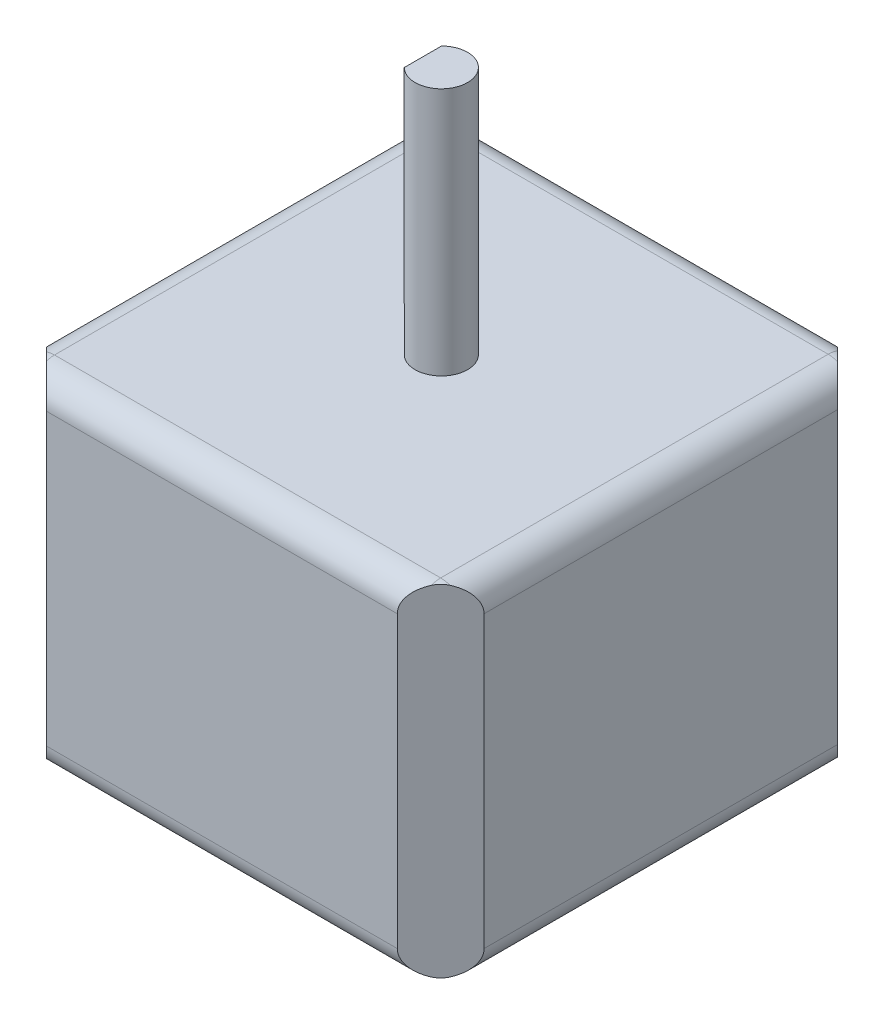
ISO-10303-21;
HEADER;
FILE_DESCRIPTION(('STEP AP214'),'2;1');
FILE_NAME('part.step','',(''),(''),'','','');
FILE_SCHEMA(('AUTOMOTIVE_DESIGN { 1 0 10303 214 1 1 1 1 }'));
ENDSEC;
DATA;
#1=APPLICATION_CONTEXT('core data for automotive mechanical design processes');
#2=APPLICATION_PROTOCOL_DEFINITION('international standard','automotive_design',2000,#1);
#3=PRODUCT_CONTEXT('',#1,'mechanical');
#4=PRODUCT('Part','Part','',(#3));
#5=PRODUCT_RELATED_PRODUCT_CATEGORY('part','',(#4));
#6=PRODUCT_DEFINITION_FORMATION('','',#4);
#7=PRODUCT_DEFINITION_CONTEXT('part definition',#1,'design');
#8=PRODUCT_DEFINITION('design','',#6,#7);
#9=PRODUCT_DEFINITION_SHAPE('','',#8);
#10=(LENGTH_UNIT() NAMED_UNIT(*) SI_UNIT(.MILLI.,.METRE.));
#11=(NAMED_UNIT(*) PLANE_ANGLE_UNIT() SI_UNIT($,.RADIAN.));
#12=(NAMED_UNIT(*) SI_UNIT($,.STERADIAN.) SOLID_ANGLE_UNIT());
#13=UNCERTAINTY_MEASURE_WITH_UNIT(LENGTH_MEASURE(1.E-05),#10,'distance_accuracy_value','');
#14=(GEOMETRIC_REPRESENTATION_CONTEXT(3) GLOBAL_UNCERTAINTY_ASSIGNED_CONTEXT((#13)) GLOBAL_UNIT_ASSIGNED_CONTEXT((#10,
#11,#12)) REPRESENTATION_CONTEXT('',''));
#15=CARTESIAN_POINT('',(0.,0.,0.));
#16=DIRECTION('',(0.,0.,1.));
#17=DIRECTION('',(1.,0.,0.));
#18=AXIS2_PLACEMENT_3D('',#15,#16,#17);
#19=CARTESIAN_POINT('',(-21.1455,-16.51,42.418));
#20=DIRECTION('',(1.,0.,0.));
#21=DIRECTION('',(0.,0.,-1.));
#22=AXIS2_PLACEMENT_3D('',#19,#20,#21);
#23=PLANE('',#22);
#24=DIRECTION('',(0.,-1.,0.));
#25=VECTOR('',#24,1.);
#26=CARTESIAN_POINT('',(-21.1455,40.4759,4.31052293811318));
#27=LINE('',#26,#25);
#28=CARTESIAN_POINT('',(-21.1455,13.97,4.31052293811318));
#29=VERTEX_POINT('',#28);
#30=CARTESIAN_POINT('',(-21.1455,-13.97,4.31052293811318));
#31=VERTEX_POINT('',#30);
#32=EDGE_CURVE('E63',#29,#31,#27,.T.);
#33=ORIENTED_EDGE('',*,*,#32,.T.);
#34=DIRECTION('',(0.,0.,-1.));
#35=VECTOR('',#34,1.);
#36=CARTESIAN_POINT('',(-21.1455,-13.97,42.418));
#37=LINE('',#36,#35);
#38=CARTESIAN_POINT('',(-21.1455,-13.97,38.1074770618868));
#39=VERTEX_POINT('',#38);
#40=EDGE_CURVE('E217',#31,#39,#37,.F.);
#41=ORIENTED_EDGE('',*,*,#40,.T.);
#42=DIRECTION('',(0.,-1.,0.));
#43=VECTOR('',#42,1.);
#44=CARTESIAN_POINT('',(-21.1455,40.4759,38.1074770618868));
#45=LINE('',#44,#43);
#46=CARTESIAN_POINT('',(-21.1455,13.97,38.1074770618868));
#47=VERTEX_POINT('',#46);
#48=EDGE_CURVE('E340',#47,#39,#45,.T.);
#49=ORIENTED_EDGE('',*,*,#48,.F.);
#50=DIRECTION('',(0.,0.,-1.));
#51=VECTOR('',#50,1.);
#52=CARTESIAN_POINT('',(-21.1455,13.97,42.418));
#53=LINE('',#52,#51);
#54=EDGE_CURVE('E332',#47,#29,#53,.T.);
#55=ORIENTED_EDGE('',*,*,#54,.T.);
#56=EDGE_LOOP('',(#33,#41,#49,#55));
#57=FACE_BOUND('',#56,.T.);
#58=ADVANCED_FACE('F39',(#57),#23,.F.);
#59=CARTESIAN_POINT('',(21.1455,-16.51,42.418));
#60=DIRECTION('',(-1.,0.,0.));
#61=DIRECTION('',(0.,-1.,0.));
#62=AXIS2_PLACEMENT_3D('',#59,#60,#61);
#63=PLANE('',#62);
#64=DIRECTION('',(0.,-1.,0.));
#65=VECTOR('',#64,1.);
#66=CARTESIAN_POINT('',(21.1455,40.4759,38.2344770618868));
#67=LINE('',#66,#65);
#68=CARTESIAN_POINT('',(21.1455,13.97,38.2344770618868));
#69=VERTEX_POINT('',#68);
#70=CARTESIAN_POINT('',(21.1455,-13.97,38.2344770618868));
#71=VERTEX_POINT('',#70);
#72=EDGE_CURVE('E565',#69,#71,#67,.T.);
#73=ORIENTED_EDGE('',*,*,#72,.T.);
#74=DIRECTION('',(0.,0.,-1.));
#75=VECTOR('',#74,1.);
#76=CARTESIAN_POINT('',(21.1455,-13.97,42.418));
#77=LINE('',#76,#75);
#78=CARTESIAN_POINT('',(21.1455,-13.97,4.18352293811319));
#79=VERTEX_POINT('',#78);
#80=EDGE_CURVE('E313',#71,#79,#77,.T.);
#81=ORIENTED_EDGE('',*,*,#80,.T.);
#82=DIRECTION('',(0.,-1.,0.));
#83=VECTOR('',#82,1.);
#84=CARTESIAN_POINT('',(21.1455,40.4759,4.1835229381132));
#85=LINE('',#84,#83);
#86=CARTESIAN_POINT('',(21.1455,13.97,4.18352293811319));
#87=VERTEX_POINT('',#86);
#88=EDGE_CURVE('E550',#87,#79,#85,.T.);
#89=ORIENTED_EDGE('',*,*,#88,.F.);
#90=DIRECTION('',(0.,0.,-1.));
#91=VECTOR('',#90,1.);
#92=CARTESIAN_POINT('',(21.1455,13.97,42.418));
#93=LINE('',#92,#91);
#94=EDGE_CURVE('E309',#87,#69,#93,.F.);
#95=ORIENTED_EDGE('',*,*,#94,.T.);
#96=EDGE_LOOP('',(#73,#81,#89,#95));
#97=FACE_BOUND('',#96,.T.);
#98=ADVANCED_FACE('F407',(#97),#63,.F.);
#99=CARTESIAN_POINT('',(0.,0.,42.418));
#100=DIRECTION('',(0.,0.,1.));
#101=DIRECTION('',(1.,0.,0.));
#102=AXIS2_PLACEMENT_3D('',#99,#100,#101);
#103=PLANE('',#102);
#104=DIRECTION('',(1.,0.,0.));
#105=VECTOR('',#104,1.);
#106=CARTESIAN_POINT('',(21.1455,-13.97,42.418));
#107=LINE('',#106,#105);
#108=CARTESIAN_POINT('',(-16.8349770618868,-13.97,42.418));
#109=VERTEX_POINT('',#108);
#110=CARTESIAN_POINT('',(16.9619770618868,-13.97,42.418));
#111=VERTEX_POINT('',#110);
#112=EDGE_CURVE('E278',#109,#111,#107,.T.);
#113=ORIENTED_EDGE('',*,*,#112,.T.);
#114=DIRECTION('',(0.,-1.,0.));
#115=VECTOR('',#114,1.);
#116=CARTESIAN_POINT('',(16.9619770618868,40.4759,42.418));
#117=LINE('',#116,#115);
#118=CARTESIAN_POINT('',(16.9619770618868,13.97,42.418));
#119=VERTEX_POINT('',#118);
#120=EDGE_CURVE('E575',#119,#111,#117,.T.);
#121=ORIENTED_EDGE('',*,*,#120,.F.);
#122=DIRECTION('',(-1.,0.,0.));
#123=VECTOR('',#122,1.);
#124=CARTESIAN_POINT('',(-21.1455,13.97,42.418));
#125=LINE('',#124,#123);
#126=CARTESIAN_POINT('',(-16.8349770618868,13.97,42.418));
#127=VERTEX_POINT('',#126);
#128=EDGE_CURVE('E283',#119,#127,#125,.T.);
#129=ORIENTED_EDGE('',*,*,#128,.T.);
#130=DIRECTION('',(0.,-1.,0.));
#131=VECTOR('',#130,1.);
#132=CARTESIAN_POINT('',(-16.8349770618868,40.4759,42.418));
#133=LINE('',#132,#131);
#134=EDGE_CURVE('E518',#127,#109,#133,.T.);
#135=ORIENTED_EDGE('',*,*,#134,.T.);
#136=EDGE_LOOP('',(#113,#121,#129,#135));
#137=FACE_BOUND('',#136,.T.);
#138=ADVANCED_FACE('F412',(#137),#103,.T.);
#139=CARTESIAN_POINT('',(0.,0.,0.));
#140=DIRECTION('',(0.,0.,1.));
#141=DIRECTION('',(1.,0.,0.));
#142=AXIS2_PLACEMENT_3D('',#139,#140,#141);
#143=PLANE('',#142);
#144=DIRECTION('',(0.,-1.,0.));
#145=VECTOR('',#144,1.);
#146=CARTESIAN_POINT('',(-16.8349770618868,40.4759,0.));
#147=LINE('',#146,#145);
#148=CARTESIAN_POINT('',(-16.8349770618868,13.97,0.));
#149=VERTEX_POINT('',#148);
#150=CARTESIAN_POINT('',(-16.8349770618868,-13.97,0.));
#151=VERTEX_POINT('',#150);
#152=EDGE_CURVE('E497',#149,#151,#147,.T.);
#153=ORIENTED_EDGE('',*,*,#152,.F.);
#154=DIRECTION('',(-1.,0.,0.));
#155=VECTOR('',#154,1.);
#156=CARTESIAN_POINT('',(0.,13.97,0.));
#157=LINE('',#156,#155);
#158=CARTESIAN_POINT('',(16.9619770618868,13.97,0.));
#159=VERTEX_POINT('',#158);
#160=EDGE_CURVE('E206',#149,#159,#157,.F.);
#161=ORIENTED_EDGE('',*,*,#160,.T.);
#162=DIRECTION('',(0.,-1.,0.));
#163=VECTOR('',#162,1.);
#164=CARTESIAN_POINT('',(16.9619770618868,40.4759,0.));
#165=LINE('',#164,#163);
#166=CARTESIAN_POINT('',(16.9619770618868,-13.97,0.));
#167=VERTEX_POINT('',#166);
#168=EDGE_CURVE('E190',#159,#167,#165,.T.);
#169=ORIENTED_EDGE('',*,*,#168,.T.);
#170=DIRECTION('',(1.,0.,0.));
#171=VECTOR('',#170,1.);
#172=CARTESIAN_POINT('',(0.,-13.97,0.));
#173=LINE('',#172,#171);
#174=EDGE_CURVE('E48',#167,#151,#173,.F.);
#175=ORIENTED_EDGE('',*,*,#174,.T.);
#176=EDGE_LOOP('',(#153,#161,#169,#175));
#177=FACE_BOUND('',#176,.T.);
#178=ADVANCED_FACE('F204',(#177),#143,.F.);
#179=CARTESIAN_POINT('',(21.1455,-13.97,2.54));
#180=DIRECTION('',(1.,0.,0.));
#181=DIRECTION('',(0.,0.,-1.));
#182=AXIS2_PLACEMENT_3D('',#179,#180,#181);
#183=CYLINDRICAL_SURFACE('',#182,2.54);
#184=CARTESIAN_POINT('',(-18.6055,-13.97,2.54));
#185=DIRECTION('',(-1.,0.,0.));
#186=DIRECTION('',(0.,0.,1.));
#187=AXIS2_PLACEMENT_3D('',#184,#185,#186);
#188=CIRCLE('',#187,2.54);
#189=CARTESIAN_POINT('',(-18.6055,-16.3906414544972,1.77052293811319));
#190=VERTEX_POINT('',#189);
#191=CARTESIAN_POINT('',(-18.6055,-16.51,2.54));
#192=VERTEX_POINT('',#191);
#193=EDGE_CURVE('E274',#190,#192,#188,.T.);
#194=ORIENTED_EDGE('',*,*,#193,.F.);
#195=CARTESIAN_POINT('',(-19.3749770618868,-13.97,2.54));
#196=DIRECTION('',(-0.707106781186548,0.,-0.707106781186547));
#197=DIRECTION('',(0.707106781186547,0.,-0.707106781186548));
#198=AXIS2_PLACEMENT_3D('',#195,#196,#197);
#199=ELLIPSE('',#198,3.59210244842766,2.54);
#200=EDGE_CURVE('E213',#151,#190,#199,.T.);
#201=ORIENTED_EDGE('',*,*,#200,.F.);
#202=ORIENTED_EDGE('',*,*,#174,.F.);
#203=CARTESIAN_POINT('',(19.5019770618868,-13.97,2.54));
#204=DIRECTION('',(-0.707106781186549,0.,0.707106781186546));
#205=DIRECTION('',(0.707106781186546,0.,0.707106781186549));
#206=AXIS2_PLACEMENT_3D('',#203,#204,#205);
#207=ELLIPSE('',#206,3.59210244842765,2.54);
#208=CARTESIAN_POINT('',(18.6055,-16.3465371609783,1.64352293811318));
#209=VERTEX_POINT('',#208);
#210=EDGE_CURVE('E187',#167,#209,#207,.T.);
#211=ORIENTED_EDGE('',*,*,#210,.T.);
#212=CARTESIAN_POINT('',(18.6055,-13.97,2.54));
#213=DIRECTION('',(1.,0.,0.));
#214=DIRECTION('',(0.,0.,-1.));
#215=AXIS2_PLACEMENT_3D('',#212,#213,#214);
#216=CIRCLE('',#215,2.54);
#217=CARTESIAN_POINT('',(18.6055,-16.51,2.54));
#218=VERTEX_POINT('',#217);
#219=EDGE_CURVE('E276',#218,#209,#216,.T.);
#220=ORIENTED_EDGE('',*,*,#219,.F.);
#221=DIRECTION('',(1.,0.,0.));
#222=VECTOR('',#221,1.);
#223=CARTESIAN_POINT('',(21.1455,-16.51,2.54));
#224=LINE('',#223,#222);
#225=EDGE_CURVE('E321',#192,#218,#224,.T.);
#226=ORIENTED_EDGE('',*,*,#225,.F.);
#227=EDGE_LOOP('',(#194,#201,#202,#211,#220,#226));
#228=FACE_BOUND('',#227,.T.);
#229=ADVANCED_FACE('F41',(#228),#183,.T.);
#230=CARTESIAN_POINT('',(-18.6055,-13.97,2.54));
#231=DIRECTION('',(0.,0.,1.));
#232=DIRECTION('',(1.,0.,0.));
#233=AXIS2_PLACEMENT_3D('',#230,#231,#232);
#234=SPHERICAL_SURFACE('',#233,2.54);
#235=CARTESIAN_POINT('',(-18.6055,-13.97,2.54));
#236=DIRECTION('',(0.,0.,-1.));
#237=DIRECTION('',(-1.,0.,0.));
#238=AXIS2_PLACEMENT_3D('',#235,#236,#237);
#239=CIRCLE('',#238,2.54);
#240=CARTESIAN_POINT('',(-19.3749770618868,-16.3906414544972,2.54));
#241=VERTEX_POINT('',#240);
#242=EDGE_CURVE('E266',#241,#192,#239,.F.);
#243=ORIENTED_EDGE('',*,*,#242,.F.);
#244=CARTESIAN_POINT('',(-18.9902385309434,-13.97,2.15526146905659));
#245=DIRECTION('',(-0.707106781186548,0.,-0.707106781186547));
#246=DIRECTION('',(-0.707106781186547,0.,0.707106781186548));
#247=AXIS2_PLACEMENT_3D('',#244,#245,#246);
#248=CIRCLE('',#247,2.48103859817114);
#249=EDGE_CURVE('E208',#190,#241,#248,.T.);
#250=ORIENTED_EDGE('',*,*,#249,.F.);
#251=ORIENTED_EDGE('',*,*,#193,.T.);
#252=EDGE_LOOP('',(#243,#250,#251));
#253=FACE_BOUND('',#252,.T.);
#254=ADVANCED_FACE('F467',(#253),#234,.T.);
#255=CARTESIAN_POINT('',(18.6055,-13.97,42.418));
#256=DIRECTION('',(0.,0.,-1.));
#257=DIRECTION('',(-1.,0.,0.));
#258=AXIS2_PLACEMENT_3D('',#255,#256,#257);
#259=CYLINDRICAL_SURFACE('',#258,2.54);
#260=ORIENTED_EDGE('',*,*,#80,.F.);
#261=CARTESIAN_POINT('',(18.6055,-13.97,40.7744770618868));
#262=DIRECTION('',(0.707106781186548,0.,0.707106781186547));
#263=DIRECTION('',(0.707106781186547,0.,-0.707106781186548));
#264=AXIS2_PLACEMENT_3D('',#261,#262,#263);
#265=ELLIPSE('',#264,3.59210244842766,2.54);
#266=CARTESIAN_POINT('',(19.5019770618868,-16.3465371609783,39.878));
#267=VERTEX_POINT('',#266);
#268=EDGE_CURVE('E562',#267,#71,#265,.T.);
#269=ORIENTED_EDGE('',*,*,#268,.F.);
#270=CARTESIAN_POINT('',(18.6055,-13.97,39.878));
#271=DIRECTION('',(0.,0.,1.));
#272=DIRECTION('',(1.,0.,0.));
#273=AXIS2_PLACEMENT_3D('',#270,#271,#272);
#274=CIRCLE('',#273,2.54);
#275=CARTESIAN_POINT('',(18.6055,-16.51,39.878));
#276=VERTEX_POINT('',#275);
#277=EDGE_CURVE('E259',#276,#267,#274,.T.);
#278=ORIENTED_EDGE('',*,*,#277,.F.);
#279=DIRECTION('',(0.,0.,-1.));
#280=VECTOR('',#279,1.);
#281=CARTESIAN_POINT('',(18.6055,-16.51,42.418));
#282=LINE('',#281,#280);
#283=EDGE_CURVE('E317',#218,#276,#282,.F.);
#284=ORIENTED_EDGE('',*,*,#283,.F.);
#285=CARTESIAN_POINT('',(18.6055,-13.97,2.54));
#286=DIRECTION('',(0.,0.,-1.));
#287=DIRECTION('',(-1.,0.,0.));
#288=AXIS2_PLACEMENT_3D('',#285,#286,#287);
#289=CIRCLE('',#288,2.54);
#290=CARTESIAN_POINT('',(19.5019770618868,-16.3465371609783,2.54));
#291=VERTEX_POINT('',#290);
#292=EDGE_CURVE('E270',#218,#291,#289,.F.);
#293=ORIENTED_EDGE('',*,*,#292,.T.);
#294=CARTESIAN_POINT('',(18.6055,-13.97,1.64352293811318));
#295=DIRECTION('',(-0.707106781186549,0.,0.707106781186546));
#296=DIRECTION('',(-0.707106781186546,0.,-0.707106781186549));
#297=AXIS2_PLACEMENT_3D('',#294,#295,#296);
#298=ELLIPSE('',#297,3.59210244842767,2.54);
#299=EDGE_CURVE('E480',#291,#79,#298,.T.);
#300=ORIENTED_EDGE('',*,*,#299,.T.);
#301=EDGE_LOOP('',(#260,#269,#278,#284,#293,#300));
#302=FACE_BOUND('',#301,.T.);
#303=ADVANCED_FACE('F463',(#302),#259,.T.);
#304=CARTESIAN_POINT('',(0.,-13.97,39.878));
#305=DIRECTION('',(-1.,0.,0.));
#306=DIRECTION('',(0.,0.,1.));
#307=AXIS2_PLACEMENT_3D('',#304,#305,#306);
#308=CYLINDRICAL_SURFACE('',#307,2.54);
#309=CARTESIAN_POINT('',(18.6055,-13.97,39.878));
#310=DIRECTION('',(1.,0.,0.));
#311=DIRECTION('',(0.,0.,-1.));
#312=AXIS2_PLACEMENT_3D('',#309,#310,#311);
#313=CIRCLE('',#312,2.54);
#314=CARTESIAN_POINT('',(18.6055,-16.3465371609783,40.7744770618868));
#315=VERTEX_POINT('',#314);
#316=EDGE_CURVE('E256',#315,#276,#313,.T.);
#317=ORIENTED_EDGE('',*,*,#316,.F.);
#318=CARTESIAN_POINT('',(19.5019770618868,-13.97,39.878));
#319=DIRECTION('',(0.707106781186548,0.,0.707106781186547));
#320=DIRECTION('',(-0.707106781186547,0.,0.707106781186548));
#321=AXIS2_PLACEMENT_3D('',#318,#319,#320);
#322=ELLIPSE('',#321,3.59210244842766,2.54);
#323=EDGE_CURVE('E577',#111,#315,#322,.T.);
#324=ORIENTED_EDGE('',*,*,#323,.F.);
#325=ORIENTED_EDGE('',*,*,#112,.F.);
#326=CARTESIAN_POINT('',(-19.3749770618868,-13.97,39.878));
#327=DIRECTION('',(0.707106781186548,0.,-0.707106781186547));
#328=DIRECTION('',(-0.707106781186547,0.,-0.707106781186548));
#329=AXIS2_PLACEMENT_3D('',#326,#327,#328);
#330=ELLIPSE('',#329,3.59210244842766,2.54);
#331=CARTESIAN_POINT('',(-18.6055,-16.3906414544972,40.6474770618868));
#332=VERTEX_POINT('',#331);
#333=EDGE_CURVE('E354',#109,#332,#330,.T.);
#334=ORIENTED_EDGE('',*,*,#333,.T.);
#335=CARTESIAN_POINT('',(-18.6055,-13.97,39.878));
#336=DIRECTION('',(-1.,0.,0.));
#337=DIRECTION('',(0.,0.,1.));
#338=AXIS2_PLACEMENT_3D('',#335,#336,#337);
#339=CIRCLE('',#338,2.54);
#340=CARTESIAN_POINT('',(-18.6055,-16.51,39.878));
#341=VERTEX_POINT('',#340);
#342=EDGE_CURVE('E252',#341,#332,#339,.T.);
#343=ORIENTED_EDGE('',*,*,#342,.F.);
#344=DIRECTION('',(1.,0.,0.));
#345=VECTOR('',#344,1.);
#346=CARTESIAN_POINT('',(-21.1455,-16.51,39.878));
#347=LINE('',#346,#345);
#348=EDGE_CURVE('E324',#276,#341,#347,.F.);
#349=ORIENTED_EDGE('',*,*,#348,.F.);
#350=EDGE_LOOP('',(#317,#324,#325,#334,#343,#349));
#351=FACE_BOUND('',#350,.T.);
#352=ADVANCED_FACE('F460',(#351),#308,.T.);
#353=CARTESIAN_POINT('',(-18.6055,-13.97,42.418));
#354=DIRECTION('',(0.,0.,-1.));
#355=DIRECTION('',(-1.,0.,0.));
#356=AXIS2_PLACEMENT_3D('',#353,#354,#355);
#357=CYLINDRICAL_SURFACE('',#356,2.54);
#358=ORIENTED_EDGE('',*,*,#40,.F.);
#359=CARTESIAN_POINT('',(-18.6055,-13.97,1.77052293811318));
#360=DIRECTION('',(-0.707106781186548,0.,-0.707106781186547));
#361=DIRECTION('',(0.707106781186547,0.,-0.707106781186548));
#362=AXIS2_PLACEMENT_3D('',#359,#360,#361);
#363=ELLIPSE('',#362,3.59210244842766,2.54);
#364=EDGE_CURVE('E346',#241,#31,#363,.T.);
#365=ORIENTED_EDGE('',*,*,#364,.F.);
#366=ORIENTED_EDGE('',*,*,#242,.T.);
#367=DIRECTION('',(0.,0.,-1.));
#368=VECTOR('',#367,1.);
#369=CARTESIAN_POINT('',(-18.6055,-16.51,42.418));
#370=LINE('',#369,#368);
#371=EDGE_CURVE('E328',#341,#192,#370,.T.);
#372=ORIENTED_EDGE('',*,*,#371,.F.);
#373=CARTESIAN_POINT('',(-18.6055,-13.97,39.878));
#374=DIRECTION('',(0.,0.,1.));
#375=DIRECTION('',(1.,0.,0.));
#376=AXIS2_PLACEMENT_3D('',#373,#374,#375);
#377=CIRCLE('',#376,2.54);
#378=CARTESIAN_POINT('',(-19.3749770618868,-16.3906414544972,39.878));
#379=VERTEX_POINT('',#378);
#380=EDGE_CURVE('E249',#379,#341,#377,.T.);
#381=ORIENTED_EDGE('',*,*,#380,.F.);
#382=CARTESIAN_POINT('',(-18.6055,-13.97,40.6474770618868));
#383=DIRECTION('',(0.707106781186548,0.,-0.707106781186547));
#384=DIRECTION('',(-0.707106781186547,0.,-0.707106781186548));
#385=AXIS2_PLACEMENT_3D('',#382,#383,#384);
#386=ELLIPSE('',#385,3.59210244842766,2.54);
#387=EDGE_CURVE('E349',#379,#39,#386,.T.);
#388=ORIENTED_EDGE('',*,*,#387,.T.);
#389=EDGE_LOOP('',(#358,#365,#366,#372,#381,#388));
#390=FACE_BOUND('',#389,.T.);
#391=ADVANCED_FACE('F345',(#390),#357,.T.);
#392=CARTESIAN_POINT('',(21.1455,13.97,2.54));
#393=DIRECTION('',(-1.,0.,0.));
#394=DIRECTION('',(0.,-1.,0.));
#395=AXIS2_PLACEMENT_3D('',#392,#393,#394);
#396=CYLINDRICAL_SURFACE('',#395,2.54);
#397=ORIENTED_EDGE('',*,*,#160,.F.);
#398=CARTESIAN_POINT('',(-19.3749770618868,13.97,2.54));
#399=DIRECTION('',(-0.707106781186548,0.,-0.707106781186547));
#400=DIRECTION('',(-0.707106781186547,0.,0.707106781186548));
#401=AXIS2_PLACEMENT_3D('',#398,#399,#400);
#402=ELLIPSE('',#401,3.59210244842766,2.54);
#403=CARTESIAN_POINT('',(-18.6055,16.3906414544971,1.77052293811319));
#404=VERTEX_POINT('',#403);
#405=EDGE_CURVE('E509',#404,#149,#402,.T.);
#406=ORIENTED_EDGE('',*,*,#405,.F.);
#407=CARTESIAN_POINT('',(-18.6055,13.97,2.54));
#408=DIRECTION('',(-1.,0.,0.));
#409=DIRECTION('',(0.,0.,1.));
#410=AXIS2_PLACEMENT_3D('',#407,#408,#409);
#411=CIRCLE('',#410,2.54);
#412=CARTESIAN_POINT('',(-18.6055,16.51,2.54));
#413=VERTEX_POINT('',#412);
#414=EDGE_CURVE('E245',#413,#404,#411,.T.);
#415=ORIENTED_EDGE('',*,*,#414,.F.);
#416=DIRECTION('',(-1.,0.,0.));
#417=VECTOR('',#416,1.);
#418=CARTESIAN_POINT('',(21.1455,16.51,2.54));
#419=LINE('',#418,#417);
#420=CARTESIAN_POINT('',(18.6055,16.51,2.54));
#421=VERTEX_POINT('',#420);
#422=EDGE_CURVE('E298',#421,#413,#419,.T.);
#423=ORIENTED_EDGE('',*,*,#422,.F.);
#424=CARTESIAN_POINT('',(18.6055,13.97,2.54));
#425=DIRECTION('',(1.,0.,0.));
#426=DIRECTION('',(0.,0.,-1.));
#427=AXIS2_PLACEMENT_3D('',#424,#425,#426);
#428=CIRCLE('',#427,2.54);
#429=CARTESIAN_POINT('',(18.6055,16.3465371609783,1.64352293811318));
#430=VERTEX_POINT('',#429);
#431=EDGE_CURVE('E263',#430,#421,#428,.T.);
#432=ORIENTED_EDGE('',*,*,#431,.F.);
#433=CARTESIAN_POINT('',(19.5019770618868,13.97,2.54));
#434=DIRECTION('',(-0.707106781186549,0.,0.707106781186546));
#435=DIRECTION('',(-0.707106781186546,0.,-0.707106781186549));
#436=AXIS2_PLACEMENT_3D('',#433,#434,#435);
#437=ELLIPSE('',#436,3.59210244842765,2.54);
#438=EDGE_CURVE('E548',#430,#159,#437,.T.);
#439=ORIENTED_EDGE('',*,*,#438,.T.);
#440=EDGE_LOOP('',(#397,#406,#415,#423,#432,#439));
#441=FACE_BOUND('',#440,.T.);
#442=ADVANCED_FACE('F449',(#441),#396,.T.);
#443=CARTESIAN_POINT('',(18.6055,-13.97,39.878));
#444=DIRECTION('',(0.,0.,1.));
#445=DIRECTION('',(1.,0.,0.));
#446=AXIS2_PLACEMENT_3D('',#443,#444,#445);
#447=SPHERICAL_SURFACE('',#446,2.54);
#448=ORIENTED_EDGE('',*,*,#277,.T.);
#449=CARTESIAN_POINT('',(19.0537385309434,-13.97,40.3262385309434));
#450=DIRECTION('',(0.707106781186548,0.,0.707106781186547));
#451=DIRECTION('',(0.707106781186547,0.,-0.707106781186548));
#452=AXIS2_PLACEMENT_3D('',#449,#450,#451);
#453=CIRCLE('',#452,2.45962689015131);
#454=EDGE_CURVE('E517',#315,#267,#453,.T.);
#455=ORIENTED_EDGE('',*,*,#454,.F.);
#456=ORIENTED_EDGE('',*,*,#316,.T.);
#457=EDGE_LOOP('',(#448,#455,#456));
#458=FACE_BOUND('',#457,.T.);
#459=ADVANCED_FACE('F441',(#458),#447,.T.);
#460=CARTESIAN_POINT('',(-18.6055,13.97,2.54));
#461=DIRECTION('',(0.,0.,1.));
#462=DIRECTION('',(1.,0.,0.));
#463=AXIS2_PLACEMENT_3D('',#460,#461,#462);
#464=SPHERICAL_SURFACE('',#463,2.54);
#465=ORIENTED_EDGE('',*,*,#414,.T.);
#466=CARTESIAN_POINT('',(-18.9902385309434,13.97,2.15526146905659));
#467=DIRECTION('',(-0.707106781186548,0.,-0.707106781186547));
#468=DIRECTION('',(-0.707106781186547,0.,0.707106781186548));
#469=AXIS2_PLACEMENT_3D('',#466,#467,#468);
#470=CIRCLE('',#469,2.48103859817114);
#471=CARTESIAN_POINT('',(-19.3749770618868,16.3906414544971,2.54));
#472=VERTEX_POINT('',#471);
#473=EDGE_CURVE('E494',#472,#404,#470,.T.);
#474=ORIENTED_EDGE('',*,*,#473,.F.);
#475=CARTESIAN_POINT('',(-18.6055,13.97,2.54));
#476=DIRECTION('',(0.,0.,-1.));
#477=DIRECTION('',(-1.,0.,0.));
#478=AXIS2_PLACEMENT_3D('',#475,#476,#477);
#479=CIRCLE('',#478,2.54);
#480=EDGE_CURVE('E237',#413,#472,#479,.F.);
#481=ORIENTED_EDGE('',*,*,#480,.F.);
#482=EDGE_LOOP('',(#465,#474,#481));
#483=FACE_BOUND('',#482,.T.);
#484=ADVANCED_FACE('F437',(#483),#464,.T.);
#485=CARTESIAN_POINT('',(18.6055,13.97,42.418));
#486=DIRECTION('',(0.,0.,-1.));
#487=DIRECTION('',(-1.,0.,0.));
#488=AXIS2_PLACEMENT_3D('',#485,#486,#487);
#489=CYLINDRICAL_SURFACE('',#488,2.54);
#490=CARTESIAN_POINT('',(18.6055,13.97,39.878));
#491=DIRECTION('',(0.,0.,1.));
#492=DIRECTION('',(1.,0.,0.));
#493=AXIS2_PLACEMENT_3D('',#490,#491,#492);
#494=CIRCLE('',#493,2.54);
#495=CARTESIAN_POINT('',(19.5019770618868,16.3465371609783,39.878));
#496=VERTEX_POINT('',#495);
#497=CARTESIAN_POINT('',(18.6055,16.51,39.878));
#498=VERTEX_POINT('',#497);
#499=EDGE_CURVE('E234',#496,#498,#494,.T.);
#500=ORIENTED_EDGE('',*,*,#499,.F.);
#501=CARTESIAN_POINT('',(18.6055,13.97,40.7744770618868));
#502=DIRECTION('',(0.707106781186548,0.,0.707106781186547));
#503=DIRECTION('',(0.707106781186547,0.,-0.707106781186548));
#504=AXIS2_PLACEMENT_3D('',#501,#502,#503);
#505=ELLIPSE('',#504,3.59210244842766,2.54);
#506=EDGE_CURVE('E569',#69,#496,#505,.T.);
#507=ORIENTED_EDGE('',*,*,#506,.F.);
#508=ORIENTED_EDGE('',*,*,#94,.F.);
#509=CARTESIAN_POINT('',(18.6055,13.97,1.64352293811318));
#510=DIRECTION('',(-0.707106781186549,0.,0.707106781186546));
#511=DIRECTION('',(-0.707106781186546,0.,-0.707106781186549));
#512=AXIS2_PLACEMENT_3D('',#509,#510,#511);
#513=ELLIPSE('',#512,3.59210244842767,2.54);
#514=CARTESIAN_POINT('',(19.5019770618868,16.3465371609783,2.54));
#515=VERTEX_POINT('',#514);
#516=EDGE_CURVE('E209',#87,#515,#513,.T.);
#517=ORIENTED_EDGE('',*,*,#516,.T.);
#518=CARTESIAN_POINT('',(18.6055,13.97,2.54));
#519=DIRECTION('',(0.,0.,-1.));
#520=DIRECTION('',(-1.,0.,0.));
#521=AXIS2_PLACEMENT_3D('',#518,#519,#520);
#522=CIRCLE('',#521,2.54);
#523=EDGE_CURVE('E241',#515,#421,#522,.F.);
#524=ORIENTED_EDGE('',*,*,#523,.T.);
#525=DIRECTION('',(0.,0.,-1.));
#526=VECTOR('',#525,1.);
#527=CARTESIAN_POINT('',(18.6055,16.51,42.418));
#528=LINE('',#527,#526);
#529=EDGE_CURVE('E301',#498,#421,#528,.T.);
#530=ORIENTED_EDGE('',*,*,#529,.F.);
#531=EDGE_LOOP('',(#500,#507,#508,#517,#524,#530));
#532=FACE_BOUND('',#531,.T.);
#533=ADVANCED_FACE('F433',(#532),#489,.T.);
#534=CARTESIAN_POINT('',(-18.6055,13.97,42.418));
#535=DIRECTION('',(0.,0.,-1.));
#536=DIRECTION('',(-1.,0.,0.));
#537=AXIS2_PLACEMENT_3D('',#534,#535,#536);
#538=CYLINDRICAL_SURFACE('',#537,2.54);
#539=ORIENTED_EDGE('',*,*,#480,.T.);
#540=CARTESIAN_POINT('',(-18.6055,13.97,1.77052293811318));
#541=DIRECTION('',(-0.707106781186548,0.,-0.707106781186547));
#542=DIRECTION('',(0.707106781186547,0.,-0.707106781186548));
#543=AXIS2_PLACEMENT_3D('',#540,#541,#542);
#544=ELLIPSE('',#543,3.59210244842766,2.54);
#545=EDGE_CURVE('E514',#29,#472,#544,.T.);
#546=ORIENTED_EDGE('',*,*,#545,.F.);
#547=ORIENTED_EDGE('',*,*,#54,.F.);
#548=CARTESIAN_POINT('',(-18.6055,13.97,40.6474770618868));
#549=DIRECTION('',(0.707106781186548,0.,-0.707106781186547));
#550=DIRECTION('',(-0.707106781186547,0.,-0.707106781186548));
#551=AXIS2_PLACEMENT_3D('',#548,#549,#550);
#552=ELLIPSE('',#551,3.59210244842766,2.54);
#553=CARTESIAN_POINT('',(-19.3749770618868,16.3906414544971,39.878));
#554=VERTEX_POINT('',#553);
#555=EDGE_CURVE('E362',#47,#554,#552,.T.);
#556=ORIENTED_EDGE('',*,*,#555,.T.);
#557=CARTESIAN_POINT('',(-18.6055,13.97,39.878));
#558=DIRECTION('',(0.,0.,1.));
#559=DIRECTION('',(1.,0.,0.));
#560=AXIS2_PLACEMENT_3D('',#557,#558,#559);
#561=CIRCLE('',#560,2.54);
#562=CARTESIAN_POINT('',(-18.6055,16.51,39.878));
#563=VERTEX_POINT('',#562);
#564=EDGE_CURVE('E230',#563,#554,#561,.T.);
#565=ORIENTED_EDGE('',*,*,#564,.F.);
#566=DIRECTION('',(0.,0.,-1.));
#567=VECTOR('',#566,1.);
#568=CARTESIAN_POINT('',(-18.6055,16.51,42.418));
#569=LINE('',#568,#567);
#570=EDGE_CURVE('E291',#413,#563,#569,.F.);
#571=ORIENTED_EDGE('',*,*,#570,.F.);
#572=EDGE_LOOP('',(#539,#546,#547,#556,#565,#571));
#573=FACE_BOUND('',#572,.T.);
#574=ADVANCED_FACE('F429',(#573),#538,.T.);
#575=CARTESIAN_POINT('',(18.6055,13.97,39.878));
#576=DIRECTION('',(0.,0.,1.));
#577=DIRECTION('',(1.,0.,0.));
#578=AXIS2_PLACEMENT_3D('',#575,#576,#577);
#579=SPHERICAL_SURFACE('',#578,2.54);
#580=CARTESIAN_POINT('',(18.6055,13.97,39.878));
#581=DIRECTION('',(1.,0.,0.));
#582=DIRECTION('',(0.,0.,-1.));
#583=AXIS2_PLACEMENT_3D('',#580,#581,#582);
#584=CIRCLE('',#583,2.54);
#585=CARTESIAN_POINT('',(18.6055,16.3465371609783,40.7744770618868));
#586=VERTEX_POINT('',#585);
#587=EDGE_CURVE('E225',#586,#498,#584,.F.);
#588=ORIENTED_EDGE('',*,*,#587,.F.);
#589=CARTESIAN_POINT('',(19.0537385309434,13.97,40.3262385309434));
#590=DIRECTION('',(0.707106781186548,0.,0.707106781186547));
#591=DIRECTION('',(0.707106781186547,0.,-0.707106781186548));
#592=AXIS2_PLACEMENT_3D('',#589,#590,#591);
#593=CIRCLE('',#592,2.45962689015131);
#594=EDGE_CURVE('E572',#496,#586,#593,.T.);
#595=ORIENTED_EDGE('',*,*,#594,.F.);
#596=ORIENTED_EDGE('',*,*,#499,.T.);
#597=EDGE_LOOP('',(#588,#595,#596));
#598=FACE_BOUND('',#597,.T.);
#599=ADVANCED_FACE('F421',(#598),#579,.T.);
#600=CARTESIAN_POINT('',(0.,13.97,39.878));
#601=DIRECTION('',(1.,0.,0.));
#602=DIRECTION('',(0.,1.,0.));
#603=AXIS2_PLACEMENT_3D('',#600,#601,#602);
#604=CYLINDRICAL_SURFACE('',#603,2.54);
#605=ORIENTED_EDGE('',*,*,#128,.F.);
#606=CARTESIAN_POINT('',(19.5019770618868,13.97,39.878));
#607=DIRECTION('',(0.707106781186548,0.,0.707106781186547));
#608=DIRECTION('',(0.707106781186547,0.,-0.707106781186548));
#609=AXIS2_PLACEMENT_3D('',#606,#607,#608);
#610=ELLIPSE('',#609,3.59210244842766,2.54);
#611=EDGE_CURVE('E500',#586,#119,#610,.T.);
#612=ORIENTED_EDGE('',*,*,#611,.F.);
#613=ORIENTED_EDGE('',*,*,#587,.T.);
#614=DIRECTION('',(-1.,0.,0.));
#615=VECTOR('',#614,1.);
#616=CARTESIAN_POINT('',(21.1455,16.51,39.878));
#617=LINE('',#616,#615);
#618=EDGE_CURVE('E305',#563,#498,#617,.F.);
#619=ORIENTED_EDGE('',*,*,#618,.F.);
#620=CARTESIAN_POINT('',(-18.6055,13.97,39.878));
#621=DIRECTION('',(-1.,0.,0.));
#622=DIRECTION('',(0.,0.,1.));
#623=AXIS2_PLACEMENT_3D('',#620,#621,#622);
#624=CIRCLE('',#623,2.54);
#625=CARTESIAN_POINT('',(-18.6055,16.3906414544971,40.6474770618868));
#626=VERTEX_POINT('',#625);
#627=EDGE_CURVE('E221',#563,#626,#624,.F.);
#628=ORIENTED_EDGE('',*,*,#627,.T.);
#629=CARTESIAN_POINT('',(-19.3749770618868,13.97,39.878));
#630=DIRECTION('',(0.707106781186548,0.,-0.707106781186547));
#631=DIRECTION('',(0.707106781186547,0.,0.707106781186548));
#632=AXIS2_PLACEMENT_3D('',#629,#630,#631);
#633=ELLIPSE('',#632,3.59210244842766,2.54);
#634=EDGE_CURVE('E521',#626,#127,#633,.T.);
#635=ORIENTED_EDGE('',*,*,#634,.T.);
#636=EDGE_LOOP('',(#605,#612,#613,#619,#628,#635));
#637=FACE_BOUND('',#636,.T.);
#638=ADVANCED_FACE('F418',(#637),#604,.T.);
#639=CARTESIAN_POINT('',(0.,40.4749,21.209));
#640=DIRECTION('',(0.,-1.,0.));
#641=DIRECTION('',(1.,0.,0.));
#642=AXIS2_PLACEMENT_3D('',#639,#640,#641);
#643=CYLINDRICAL_SURFACE('',#642,2.5273);
#644=CARTESIAN_POINT('',(0.,16.51,21.209));
#645=DIRECTION('',(0.,-1.,0.));
#646=DIRECTION('',(1.,0.,0.));
#647=AXIS2_PLACEMENT_3D('',#644,#645,#646);
#648=CIRCLE('',#647,2.5273);
#649=CARTESIAN_POINT('',(2.5273,16.51,21.209));
#650=VERTEX_POINT('',#649);
#651=EDGE_CURVE('E11',#650,#650,#648,.F.);
#652=ORIENTED_EDGE('',*,*,#651,.T.);
#653=EDGE_LOOP('',(#652));
#654=FACE_BOUND('',#653,.T.);
#655=DIRECTION('',(0.,1.,0.));
#656=VECTOR('',#655,1.);
#657=CARTESIAN_POINT('',(-1.778,22.1869,19.4129038750668));
#658=LINE('',#657,#656);
#659=CARTESIAN_POINT('',(-1.778,22.1869,19.4129038750668));
#660=VERTEX_POINT('',#659);
#661=CARTESIAN_POINT('',(-1.77800000000001,40.4749,19.4129038750668));
#662=VERTEX_POINT('',#661);
#663=EDGE_CURVE('E373',#660,#662,#658,.T.);
#664=ORIENTED_EDGE('',*,*,#663,.T.);
#665=CARTESIAN_POINT('',(0.,40.4749,21.209));
#666=DIRECTION('',(0.,1.,0.));
#667=DIRECTION('',(-1.,0.,0.));
#668=AXIS2_PLACEMENT_3D('',#665,#666,#667);
#669=CIRCLE('',#668,2.5273);
#670=CARTESIAN_POINT('',(-1.77800000000001,40.4749,23.0050961249332));
#671=VERTEX_POINT('',#670);
#672=EDGE_CURVE('E226',#671,#662,#669,.T.);
#673=ORIENTED_EDGE('',*,*,#672,.F.);
#674=DIRECTION('',(0.,1.,0.));
#675=VECTOR('',#674,1.);
#676=CARTESIAN_POINT('',(-1.778,22.1869,23.0050961249332));
#677=LINE('',#676,#675);
#678=CARTESIAN_POINT('',(-1.778,22.1869,23.0050961249332));
#679=VERTEX_POINT('',#678);
#680=EDGE_CURVE('E377',#679,#671,#677,.T.);
#681=ORIENTED_EDGE('',*,*,#680,.F.);
#682=CARTESIAN_POINT('',(0.,22.1869,21.209));
#683=DIRECTION('',(0.,1.,0.));
#684=DIRECTION('',(0.,0.,1.));
#685=AXIS2_PLACEMENT_3D('',#682,#683,#684);
#686=CIRCLE('',#685,2.5273);
#687=EDGE_CURVE('E369',#660,#679,#686,.T.);
#688=ORIENTED_EDGE('',*,*,#687,.F.);
#689=EDGE_LOOP('',(#664,#673,#681,#688));
#690=FACE_BOUND('',#689,.T.);
#691=ADVANCED_FACE('F385',(#654,#690),#643,.T.);
#692=CARTESIAN_POINT('',(0.,40.4749,21.209));
#693=DIRECTION('',(0.,1.,0.));
#694=DIRECTION('',(-1.,0.,0.));
#695=AXIS2_PLACEMENT_3D('',#692,#693,#694);
#696=PLANE('',#695);
#697=ORIENTED_EDGE('',*,*,#672,.T.);
#698=DIRECTION('',(0.,0.,1.));
#699=VECTOR('',#698,1.);
#700=CARTESIAN_POINT('',(-1.77800000000001,40.4749,0.));
#701=LINE('',#700,#699);
#702=EDGE_CURVE('E360',#662,#671,#701,.T.);
#703=ORIENTED_EDGE('',*,*,#702,.T.);
#704=EDGE_LOOP('',(#697,#703));
#705=FACE_BOUND('',#704,.T.);
#706=ADVANCED_FACE('F390',(#705),#696,.T.);
#707=CARTESIAN_POINT('',(21.1455,-16.51,42.418));
#708=DIRECTION('',(0.,1.,0.));
#709=DIRECTION('',(0.,0.,1.));
#710=AXIS2_PLACEMENT_3D('',#707,#708,#709);
#711=PLANE('',#710);
#712=ORIENTED_EDGE('',*,*,#348,.T.);
#713=ORIENTED_EDGE('',*,*,#371,.T.);
#714=ORIENTED_EDGE('',*,*,#225,.T.);
#715=ORIENTED_EDGE('',*,*,#283,.T.);
#716=EDGE_LOOP('',(#712,#713,#714,#715));
#717=FACE_BOUND('',#716,.T.);
#718=ADVANCED_FACE('F417',(#717),#711,.F.);
#719=CARTESIAN_POINT('',(21.1455,16.51,42.418));
#720=DIRECTION('',(0.,-1.,0.));
#721=DIRECTION('',(1.,0.,0.));
#722=AXIS2_PLACEMENT_3D('',#719,#720,#721);
#723=PLANE('',#722);
#724=ORIENTED_EDGE('',*,*,#651,.F.);
#725=EDGE_LOOP('',(#724));
#726=FACE_BOUND('',#725,.T.);
#727=ORIENTED_EDGE('',*,*,#570,.T.);
#728=ORIENTED_EDGE('',*,*,#618,.T.);
#729=ORIENTED_EDGE('',*,*,#529,.T.);
#730=ORIENTED_EDGE('',*,*,#422,.T.);
#731=EDGE_LOOP('',(#727,#728,#729,#730));
#732=FACE_BOUND('',#731,.T.);
#733=ADVANCED_FACE('F472',(#726,#732),#723,.F.);
#734=CARTESIAN_POINT('',(18.6055,-13.97,2.54));
#735=DIRECTION('',(0.,0.,1.));
#736=DIRECTION('',(1.,0.,0.));
#737=AXIS2_PLACEMENT_3D('',#734,#735,#736);
#738=SPHERICAL_SURFACE('',#737,2.54);
#739=CARTESIAN_POINT('',(19.0537385309434,-13.97,2.09176146905659));
#740=DIRECTION('',(-0.707106781186549,0.,0.707106781186546));
#741=DIRECTION('',(0.707106781186546,0.,0.707106781186549));
#742=AXIS2_PLACEMENT_3D('',#739,#740,#741);
#743=CIRCLE('',#742,2.45962689015131);
#744=EDGE_CURVE('E193',#209,#291,#743,.T.);
#745=ORIENTED_EDGE('',*,*,#744,.T.);
#746=ORIENTED_EDGE('',*,*,#292,.F.);
#747=ORIENTED_EDGE('',*,*,#219,.T.);
#748=EDGE_LOOP('',(#745,#746,#747));
#749=FACE_BOUND('',#748,.T.);
#750=ADVANCED_FACE('F453',(#749),#738,.T.);
#751=CARTESIAN_POINT('',(18.6055,13.97,2.54));
#752=DIRECTION('',(0.,0.,1.));
#753=DIRECTION('',(1.,0.,0.));
#754=AXIS2_PLACEMENT_3D('',#751,#752,#753);
#755=SPHERICAL_SURFACE('',#754,2.54);
#756=CARTESIAN_POINT('',(19.0537385309434,13.97,2.09176146905659));
#757=DIRECTION('',(-0.707106781186549,0.,0.707106781186546));
#758=DIRECTION('',(0.707106781186546,0.,0.707106781186549));
#759=AXIS2_PLACEMENT_3D('',#756,#757,#758);
#760=CIRCLE('',#759,2.45962689015131);
#761=EDGE_CURVE('E55',#515,#430,#760,.T.);
#762=ORIENTED_EDGE('',*,*,#761,.T.);
#763=ORIENTED_EDGE('',*,*,#431,.T.);
#764=ORIENTED_EDGE('',*,*,#523,.F.);
#765=EDGE_LOOP('',(#762,#763,#764));
#766=FACE_BOUND('',#765,.T.);
#767=ADVANCED_FACE('F445',(#766),#755,.T.);
#768=CARTESIAN_POINT('',(-18.6055,-13.97,39.878));
#769=DIRECTION('',(0.,0.,1.));
#770=DIRECTION('',(1.,0.,0.));
#771=AXIS2_PLACEMENT_3D('',#768,#769,#770);
#772=SPHERICAL_SURFACE('',#771,2.54);
#773=CARTESIAN_POINT('',(-18.9902385309434,-13.97,40.2627385309434));
#774=DIRECTION('',(0.707106781186548,0.,-0.707106781186547));
#775=DIRECTION('',(-0.707106781186547,0.,-0.707106781186548));
#776=AXIS2_PLACEMENT_3D('',#773,#774,#775);
#777=CIRCLE('',#776,2.48103859817114);
#778=EDGE_CURVE('E355',#332,#379,#777,.T.);
#779=ORIENTED_EDGE('',*,*,#778,.T.);
#780=ORIENTED_EDGE('',*,*,#380,.T.);
#781=ORIENTED_EDGE('',*,*,#342,.T.);
#782=EDGE_LOOP('',(#779,#780,#781));
#783=FACE_BOUND('',#782,.T.);
#784=ADVANCED_FACE('F425',(#783),#772,.T.);
#785=CARTESIAN_POINT('',(-18.6055,13.97,39.878));
#786=DIRECTION('',(0.,0.,1.));
#787=DIRECTION('',(1.,0.,0.));
#788=AXIS2_PLACEMENT_3D('',#785,#786,#787);
#789=SPHERICAL_SURFACE('',#788,2.54);
#790=CARTESIAN_POINT('',(-18.9902385309434,13.97,40.2627385309434));
#791=DIRECTION('',(0.707106781186548,0.,-0.707106781186547));
#792=DIRECTION('',(-0.707106781186547,0.,-0.707106781186548));
#793=AXIS2_PLACEMENT_3D('',#790,#791,#792);
#794=CIRCLE('',#793,2.48103859817114);
#795=EDGE_CURVE('E527',#554,#626,#794,.T.);
#796=ORIENTED_EDGE('',*,*,#795,.T.);
#797=ORIENTED_EDGE('',*,*,#627,.F.);
#798=ORIENTED_EDGE('',*,*,#564,.T.);
#799=EDGE_LOOP('',(#796,#797,#798));
#800=FACE_BOUND('',#799,.T.);
#801=ADVANCED_FACE('F404',(#800),#789,.T.);
#802=CARTESIAN_POINT('',(-1.77800000000001,22.1869,0.));
#803=DIRECTION('',(-1.,0.,0.));
#804=DIRECTION('',(0.,-1.,0.));
#805=AXIS2_PLACEMENT_3D('',#802,#803,#804);
#806=PLANE('',#805);
#807=ORIENTED_EDGE('',*,*,#702,.F.);
#808=ORIENTED_EDGE('',*,*,#663,.F.);
#809=DIRECTION('',(0.,0.,1.));
#810=VECTOR('',#809,1.);
#811=CARTESIAN_POINT('',(-1.77800000000001,22.1869,0.));
#812=LINE('',#811,#810);
#813=EDGE_CURVE('E366',#660,#679,#812,.T.);
#814=ORIENTED_EDGE('',*,*,#813,.T.);
#815=ORIENTED_EDGE('',*,*,#680,.T.);
#816=EDGE_LOOP('',(#807,#808,#814,#815));
#817=FACE_BOUND('',#816,.T.);
#818=ADVANCED_FACE('F392',(#817),#806,.T.);
#819=CARTESIAN_POINT('',(0.,22.1869,0.));
#820=DIRECTION('',(0.,1.,0.));
#821=DIRECTION('',(0.,0.,1.));
#822=AXIS2_PLACEMENT_3D('',#819,#820,#821);
#823=PLANE('',#822);
#824=ORIENTED_EDGE('',*,*,#813,.F.);
#825=ORIENTED_EDGE('',*,*,#687,.T.);
#826=EDGE_LOOP('',(#824,#825));
#827=FACE_BOUND('',#826,.T.);
#828=ADVANCED_FACE('F394',(#827),#823,.T.);
#829=CARTESIAN_POINT('',(-29.6264885309434,40.4759,29.6264885309434));
#830=DIRECTION('',(0.707106781186548,0.,-0.707106781186547));
#831=DIRECTION('',(-0.707106781186547,0.,-0.707106781186548));
#832=AXIS2_PLACEMENT_3D('',#829,#830,#831);
#833=PLANE('',#832);
#834=ORIENTED_EDGE('',*,*,#134,.F.);
#835=ORIENTED_EDGE('',*,*,#634,.F.);
#836=ORIENTED_EDGE('',*,*,#795,.F.);
#837=ORIENTED_EDGE('',*,*,#555,.F.);
#838=ORIENTED_EDGE('',*,*,#48,.T.);
#839=ORIENTED_EDGE('',*,*,#387,.F.);
#840=ORIENTED_EDGE('',*,*,#778,.F.);
#841=ORIENTED_EDGE('',*,*,#333,.F.);
#842=EDGE_LOOP('',(#834,#835,#836,#837,#838,#839,#840,#841));
#843=FACE_BOUND('',#842,.T.);
#844=ADVANCED_FACE('F396',(#843),#833,.F.);
#845=CARTESIAN_POINT('',(29.6899885309434,40.4759,29.6899885309434));
#846=DIRECTION('',(0.707106781186548,0.,0.707106781186547));
#847=DIRECTION('',(0.707106781186547,0.,-0.707106781186548));
#848=AXIS2_PLACEMENT_3D('',#845,#846,#847);
#849=PLANE('',#848);
#850=ORIENTED_EDGE('',*,*,#323,.T.);
#851=ORIENTED_EDGE('',*,*,#454,.T.);
#852=ORIENTED_EDGE('',*,*,#268,.T.);
#853=ORIENTED_EDGE('',*,*,#72,.F.);
#854=ORIENTED_EDGE('',*,*,#506,.T.);
#855=ORIENTED_EDGE('',*,*,#594,.T.);
#856=ORIENTED_EDGE('',*,*,#611,.T.);
#857=ORIENTED_EDGE('',*,*,#120,.T.);
#858=EDGE_LOOP('',(#850,#851,#852,#853,#854,#855,#856,#857));
#859=FACE_BOUND('',#858,.T.);
#860=ADVANCED_FACE('F402',(#859),#849,.T.);
#861=CARTESIAN_POINT('',(-8.41748853094341,40.4759,-8.4174885309434));
#862=DIRECTION('',(-0.707106781186548,0.,-0.707106781186547));
#863=DIRECTION('',(-0.707106781186547,0.,0.707106781186548));
#864=AXIS2_PLACEMENT_3D('',#861,#862,#863);
#865=PLANE('',#864);
#866=ORIENTED_EDGE('',*,*,#200,.T.);
#867=ORIENTED_EDGE('',*,*,#249,.T.);
#868=ORIENTED_EDGE('',*,*,#364,.T.);
#869=ORIENTED_EDGE('',*,*,#32,.F.);
#870=ORIENTED_EDGE('',*,*,#545,.T.);
#871=ORIENTED_EDGE('',*,*,#473,.T.);
#872=ORIENTED_EDGE('',*,*,#405,.T.);
#873=ORIENTED_EDGE('',*,*,#152,.T.);
#874=EDGE_LOOP('',(#866,#867,#868,#869,#870,#871,#872,#873));
#875=FACE_BOUND('',#874,.T.);
#876=ADVANCED_FACE('F546',(#875),#865,.T.);
#877=CARTESIAN_POINT('',(21.2725,40.4759,4.3105229381132));
#878=DIRECTION('',(-0.707106781186549,0.,0.707106781186546));
#879=DIRECTION('',(0.707106781186546,0.,0.707106781186549));
#880=AXIS2_PLACEMENT_3D('',#877,#878,#879);
#881=PLANE('',#880);
#882=ORIENTED_EDGE('',*,*,#168,.F.);
#883=ORIENTED_EDGE('',*,*,#438,.F.);
#884=ORIENTED_EDGE('',*,*,#761,.F.);
#885=ORIENTED_EDGE('',*,*,#516,.F.);
#886=ORIENTED_EDGE('',*,*,#88,.T.);
#887=ORIENTED_EDGE('',*,*,#299,.F.);
#888=ORIENTED_EDGE('',*,*,#744,.F.);
#889=ORIENTED_EDGE('',*,*,#210,.F.);
#890=EDGE_LOOP('',(#882,#883,#884,#885,#886,#887,#888,#889));
#891=FACE_BOUND('',#890,.T.);
#892=ADVANCED_FACE('F189',(#891),#881,.F.);
#893=CLOSED_SHELL('',(#58,#98,#138,#178,#229,#254,#303,#352,#391,#442,#459,#484,#533,#574,#599,
#638,#691,#706,#718,#733,#750,#767,#784,#801,#818,#828,#844,#860,#876,#892));
#894=MANIFOLD_SOLID_BREP('B2',#893);
#895=ADVANCED_BREP_SHAPE_REPRESENTATION('',(#18,#894),#14);
#896=SHAPE_DEFINITION_REPRESENTATION(#9,#895);
ENDSEC;
END-ISO-10303-21;
